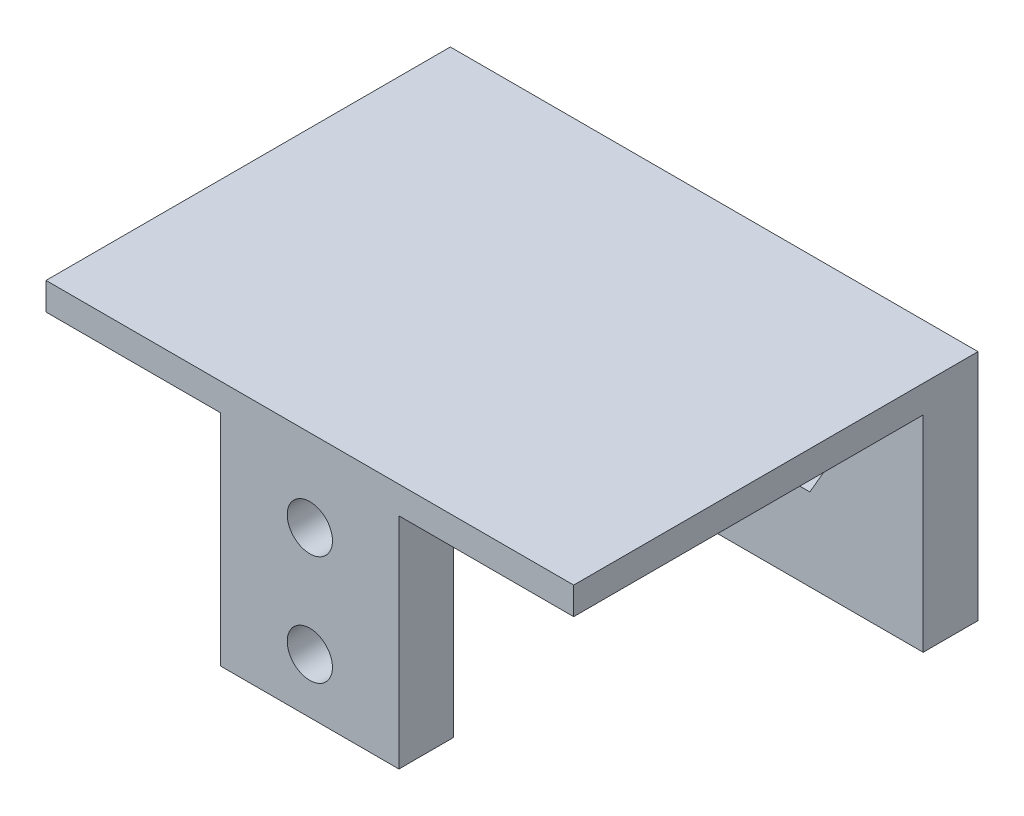
ISO-10303-21;
HEADER;
FILE_DESCRIPTION(('STEP AP214'),'2;1');
FILE_NAME('part.step','',(''),(''),'','','');
FILE_SCHEMA(('AUTOMOTIVE_DESIGN { 1 0 10303 214 1 1 1 1 }'));
ENDSEC;
DATA;
#1=APPLICATION_CONTEXT('core data for automotive mechanical design processes');
#2=APPLICATION_PROTOCOL_DEFINITION('international standard','automotive_design',2000,#1);
#3=PRODUCT_CONTEXT('',#1,'mechanical');
#4=PRODUCT('Part','Part','',(#3));
#5=PRODUCT_RELATED_PRODUCT_CATEGORY('part','',(#4));
#6=PRODUCT_DEFINITION_FORMATION('','',#4);
#7=PRODUCT_DEFINITION_CONTEXT('part definition',#1,'design');
#8=PRODUCT_DEFINITION('design','',#6,#7);
#9=PRODUCT_DEFINITION_SHAPE('','',#8);
#10=(LENGTH_UNIT() NAMED_UNIT(*) SI_UNIT(.MILLI.,.METRE.));
#11=(NAMED_UNIT(*) PLANE_ANGLE_UNIT() SI_UNIT($,.RADIAN.));
#12=(NAMED_UNIT(*) SI_UNIT($,.STERADIAN.) SOLID_ANGLE_UNIT());
#13=UNCERTAINTY_MEASURE_WITH_UNIT(LENGTH_MEASURE(1.E-05),#10,'distance_accuracy_value','');
#14=(GEOMETRIC_REPRESENTATION_CONTEXT(3) GLOBAL_UNCERTAINTY_ASSIGNED_CONTEXT((#13)) GLOBAL_UNIT_ASSIGNED_CONTEXT((#10,
#11,#12)) REPRESENTATION_CONTEXT('',''));
#15=CARTESIAN_POINT('',(0.,0.,0.));
#16=DIRECTION('',(0.,0.,1.));
#17=DIRECTION('',(1.,0.,0.));
#18=AXIS2_PLACEMENT_3D('',#15,#16,#17);
#19=CARTESIAN_POINT('',(0.,0.,0.));
#20=DIRECTION('',(0.,1.,0.));
#21=DIRECTION('',(0.,0.,1.));
#22=AXIS2_PLACEMENT_3D('',#19,#20,#21);
#23=PLANE('',#22);
#24=DIRECTION('',(-1.,0.,0.));
#25=VECTOR('',#24,1.);
#26=CARTESIAN_POINT('',(38.5,0.,4.));
#27=LINE('',#26,#25);
#28=CARTESIAN_POINT('',(38.5,0.,4.));
#29=VERTEX_POINT('',#28);
#30=CARTESIAN_POINT('',(0.,0.,4.));
#31=VERTEX_POINT('',#30);
#32=EDGE_CURVE('E298',#29,#31,#27,.T.);
#33=ORIENTED_EDGE('',*,*,#32,.F.);
#34=DIRECTION('',(0.,0.,-1.));
#35=VECTOR('',#34,1.);
#36=CARTESIAN_POINT('',(38.5,0.,0.));
#37=LINE('',#36,#35);
#38=CARTESIAN_POINT('',(38.5,0.,29.5));
#39=VERTEX_POINT('',#38);
#40=EDGE_CURVE('E346',#39,#29,#37,.T.);
#41=ORIENTED_EDGE('',*,*,#40,.F.);
#42=DIRECTION('',(1.,0.,0.));
#43=VECTOR('',#42,1.);
#44=CARTESIAN_POINT('',(0.,0.,29.5));
#45=LINE('',#44,#43);
#46=CARTESIAN_POINT('',(25.75,0.,29.5));
#47=VERTEX_POINT('',#46);
#48=EDGE_CURVE('E354',#47,#39,#45,.T.);
#49=ORIENTED_EDGE('',*,*,#48,.F.);
#50=DIRECTION('',(0.,0.,1.));
#51=VECTOR('',#50,1.);
#52=CARTESIAN_POINT('',(25.75,0.,25.5));
#53=LINE('',#52,#51);
#54=CARTESIAN_POINT('',(25.75,0.,25.5));
#55=VERTEX_POINT('',#54);
#56=EDGE_CURVE('E337',#55,#47,#53,.T.);
#57=ORIENTED_EDGE('',*,*,#56,.F.);
#58=DIRECTION('',(-1.,0.,0.));
#59=VECTOR('',#58,1.);
#60=CARTESIAN_POINT('',(12.75,0.,25.5));
#61=LINE('',#60,#59);
#62=CARTESIAN_POINT('',(12.75,0.,25.5));
#63=VERTEX_POINT('',#62);
#64=EDGE_CURVE('E322',#55,#63,#61,.T.);
#65=ORIENTED_EDGE('',*,*,#64,.T.);
#66=DIRECTION('',(0.,0.,1.));
#67=VECTOR('',#66,1.);
#68=CARTESIAN_POINT('',(12.75,0.,25.5));
#69=LINE('',#68,#67);
#70=CARTESIAN_POINT('',(12.75,0.,29.5));
#71=VERTEX_POINT('',#70);
#72=EDGE_CURVE('E333',#63,#71,#69,.T.);
#73=ORIENTED_EDGE('',*,*,#72,.T.);
#74=CARTESIAN_POINT('',(0.,0.,29.5));
#75=VERTEX_POINT('',#74);
#76=EDGE_CURVE('E355',#75,#71,#45,.T.);
#77=ORIENTED_EDGE('',*,*,#76,.F.);
#78=DIRECTION('',(0.,0.,1.));
#79=VECTOR('',#78,1.);
#80=CARTESIAN_POINT('',(0.,0.,0.));
#81=LINE('',#80,#79);
#82=EDGE_CURVE('E336',#31,#75,#81,.T.);
#83=ORIENTED_EDGE('',*,*,#82,.F.);
#84=EDGE_LOOP('',(#33,#41,#49,#57,#65,#73,#77,#83));
#85=FACE_BOUND('',#84,.T.);
#86=ADVANCED_FACE('F33',(#85),#23,.F.);
#87=CARTESIAN_POINT('',(0.,2.,0.));
#88=DIRECTION('',(1.,0.,0.));
#89=DIRECTION('',(0.,0.,-1.));
#90=AXIS2_PLACEMENT_3D('',#87,#88,#89);
#91=PLANE('',#90);
#92=DIRECTION('',(0.,-1.,0.));
#93=VECTOR('',#92,1.);
#94=CARTESIAN_POINT('',(0.,2.,0.));
#95=LINE('',#94,#93);
#96=CARTESIAN_POINT('',(0.,2.,0.));
#97=VERTEX_POINT('',#96);
#98=CARTESIAN_POINT('',(0.,-15.,0.));
#99=VERTEX_POINT('',#98);
#100=EDGE_CURVE('E352',#97,#99,#95,.T.);
#101=ORIENTED_EDGE('',*,*,#100,.T.);
#102=DIRECTION('',(0.,0.,-1.));
#103=VECTOR('',#102,1.);
#104=CARTESIAN_POINT('',(0.,-15.,0.));
#105=LINE('',#104,#103);
#106=CARTESIAN_POINT('',(0.,-15.,4.));
#107=VERTEX_POINT('',#106);
#108=EDGE_CURVE('E300',#107,#99,#105,.T.);
#109=ORIENTED_EDGE('',*,*,#108,.F.);
#110=DIRECTION('',(0.,1.,0.));
#111=VECTOR('',#110,1.);
#112=CARTESIAN_POINT('',(0.,-15.,4.));
#113=LINE('',#112,#111);
#114=EDGE_CURVE('E306',#107,#31,#113,.T.);
#115=ORIENTED_EDGE('',*,*,#114,.T.);
#116=ORIENTED_EDGE('',*,*,#82,.T.);
#117=DIRECTION('',(0.,-1.,0.));
#118=VECTOR('',#117,1.);
#119=CARTESIAN_POINT('',(0.,2.,29.5));
#120=LINE('',#119,#118);
#121=CARTESIAN_POINT('',(0.,2.,29.5));
#122=VERTEX_POINT('',#121);
#123=EDGE_CURVE('E11',#122,#75,#120,.T.);
#124=ORIENTED_EDGE('',*,*,#123,.F.);
#125=DIRECTION('',(0.,0.,1.));
#126=VECTOR('',#125,1.);
#127=CARTESIAN_POINT('',(0.,2.,0.));
#128=LINE('',#127,#126);
#129=EDGE_CURVE('E342',#97,#122,#128,.T.);
#130=ORIENTED_EDGE('',*,*,#129,.F.);
#131=EDGE_LOOP('',(#101,#109,#115,#116,#124,#130));
#132=FACE_BOUND('',#131,.T.);
#133=ADVANCED_FACE('F35',(#132),#91,.F.);
#134=CARTESIAN_POINT('',(0.,2.,29.5));
#135=DIRECTION('',(0.,0.,-1.));
#136=DIRECTION('',(-1.,0.,0.));
#137=AXIS2_PLACEMENT_3D('',#134,#135,#136);
#138=PLANE('',#137);
#139=CARTESIAN_POINT('',(19.25,-12.,29.5));
#140=DIRECTION('',(0.,0.,1.));
#141=DIRECTION('',(1.,0.,0.));
#142=AXIS2_PLACEMENT_3D('',#139,#140,#141);
#143=CIRCLE('',#142,1.65);
#144=CARTESIAN_POINT('',(20.9,-12.,29.5));
#145=VERTEX_POINT('',#144);
#146=EDGE_CURVE('E278',#145,#145,#143,.T.);
#147=ORIENTED_EDGE('',*,*,#146,.F.);
#148=EDGE_LOOP('',(#147));
#149=FACE_BOUND('',#148,.T.);
#150=CARTESIAN_POINT('',(19.25,-4.,29.5));
#151=DIRECTION('',(0.,0.,1.));
#152=DIRECTION('',(1.,0.,0.));
#153=AXIS2_PLACEMENT_3D('',#150,#151,#152);
#154=CIRCLE('',#153,1.65);
#155=CARTESIAN_POINT('',(20.9,-4.,29.5));
#156=VERTEX_POINT('',#155);
#157=EDGE_CURVE('E290',#156,#156,#154,.T.);
#158=ORIENTED_EDGE('',*,*,#157,.F.);
#159=EDGE_LOOP('',(#158));
#160=FACE_BOUND('',#159,.T.);
#161=ORIENTED_EDGE('',*,*,#76,.T.);
#162=DIRECTION('',(0.,-1.,0.));
#163=VECTOR('',#162,1.);
#164=CARTESIAN_POINT('',(12.75,0.,29.5));
#165=LINE('',#164,#163);
#166=CARTESIAN_POINT('',(12.75,-16.,29.5));
#167=VERTEX_POINT('',#166);
#168=EDGE_CURVE('E312',#71,#167,#165,.T.);
#169=ORIENTED_EDGE('',*,*,#168,.T.);
#170=DIRECTION('',(1.,0.,0.));
#171=VECTOR('',#170,1.);
#172=CARTESIAN_POINT('',(12.75,-16.,29.5));
#173=LINE('',#172,#171);
#174=CARTESIAN_POINT('',(25.75,-16.,29.5));
#175=VERTEX_POINT('',#174);
#176=EDGE_CURVE('E328',#167,#175,#173,.T.);
#177=ORIENTED_EDGE('',*,*,#176,.T.);
#178=DIRECTION('',(0.,1.,0.));
#179=VECTOR('',#178,1.);
#180=CARTESIAN_POINT('',(25.75,0.,29.5));
#181=LINE('',#180,#179);
#182=EDGE_CURVE('E317',#175,#47,#181,.T.);
#183=ORIENTED_EDGE('',*,*,#182,.T.);
#184=ORIENTED_EDGE('',*,*,#48,.T.);
#185=DIRECTION('',(0.,-1.,0.));
#186=VECTOR('',#185,1.);
#187=CARTESIAN_POINT('',(38.5,2.,29.5));
#188=LINE('',#187,#186);
#189=CARTESIAN_POINT('',(38.5,2.,29.5));
#190=VERTEX_POINT('',#189);
#191=EDGE_CURVE('E42',#190,#39,#188,.T.);
#192=ORIENTED_EDGE('',*,*,#191,.F.);
#193=DIRECTION('',(1.,0.,0.));
#194=VECTOR('',#193,1.);
#195=CARTESIAN_POINT('',(0.,2.,29.5));
#196=LINE('',#195,#194);
#197=EDGE_CURVE('E345',#122,#190,#196,.T.);
#198=ORIENTED_EDGE('',*,*,#197,.F.);
#199=ORIENTED_EDGE('',*,*,#123,.T.);
#200=EDGE_LOOP('',(#161,#169,#177,#183,#184,#192,#198,#199));
#201=FACE_BOUND('',#200,.T.);
#202=ADVANCED_FACE('F392',(#149,#160,#201),#138,.F.);
#203=CARTESIAN_POINT('',(38.5,2.,0.));
#204=DIRECTION('',(-1.,0.,0.));
#205=DIRECTION('',(0.,0.,1.));
#206=AXIS2_PLACEMENT_3D('',#203,#204,#205);
#207=PLANE('',#206);
#208=ORIENTED_EDGE('',*,*,#40,.T.);
#209=DIRECTION('',(0.,1.,0.));
#210=VECTOR('',#209,1.);
#211=CARTESIAN_POINT('',(38.5,-15.,4.));
#212=LINE('',#211,#210);
#213=CARTESIAN_POINT('',(38.5,-15.,4.));
#214=VERTEX_POINT('',#213);
#215=EDGE_CURVE('E310',#214,#29,#212,.T.);
#216=ORIENTED_EDGE('',*,*,#215,.F.);
#217=DIRECTION('',(0.,0.,1.));
#218=VECTOR('',#217,1.);
#219=CARTESIAN_POINT('',(38.5,-15.,0.));
#220=LINE('',#219,#218);
#221=CARTESIAN_POINT('',(38.5,-15.,0.));
#222=VERTEX_POINT('',#221);
#223=EDGE_CURVE('E294',#222,#214,#220,.T.);
#224=ORIENTED_EDGE('',*,*,#223,.F.);
#225=DIRECTION('',(0.,-1.,0.));
#226=VECTOR('',#225,1.);
#227=CARTESIAN_POINT('',(38.5,2.,0.));
#228=LINE('',#227,#226);
#229=CARTESIAN_POINT('',(38.5,2.,0.));
#230=VERTEX_POINT('',#229);
#231=EDGE_CURVE('E361',#230,#222,#228,.T.);
#232=ORIENTED_EDGE('',*,*,#231,.F.);
#233=DIRECTION('',(0.,0.,-1.));
#234=VECTOR('',#233,1.);
#235=CARTESIAN_POINT('',(38.5,2.,0.));
#236=LINE('',#235,#234);
#237=EDGE_CURVE('E348',#190,#230,#236,.T.);
#238=ORIENTED_EDGE('',*,*,#237,.F.);
#239=ORIENTED_EDGE('',*,*,#191,.T.);
#240=EDGE_LOOP('',(#208,#216,#224,#232,#238,#239));
#241=FACE_BOUND('',#240,.T.);
#242=ADVANCED_FACE('F402',(#241),#207,.F.);
#243=CARTESIAN_POINT('',(0.,2.,0.));
#244=DIRECTION('',(0.,0.,1.));
#245=DIRECTION('',(1.,0.,0.));
#246=AXIS2_PLACEMENT_3D('',#243,#244,#245);
#247=PLANE('',#246);
#248=CARTESIAN_POINT('',(28.5,-5.99999999999999,0.));
#249=DIRECTION('',(0.,0.,1.));
#250=DIRECTION('',(1.,0.,0.));
#251=AXIS2_PLACEMENT_3D('',#248,#249,#250);
#252=CIRCLE('',#251,1.65);
#253=CARTESIAN_POINT('',(30.15,-5.99999999999999,0.));
#254=VERTEX_POINT('',#253);
#255=EDGE_CURVE('E682',#254,#254,#252,.T.);
#256=ORIENTED_EDGE('',*,*,#255,.T.);
#257=EDGE_LOOP('',(#256));
#258=FACE_BOUND('',#257,.T.);
#259=CARTESIAN_POINT('',(10.,-6.,0.));
#260=DIRECTION('',(0.,0.,1.));
#261=DIRECTION('',(1.,0.,0.));
#262=AXIS2_PLACEMENT_3D('',#259,#260,#261);
#263=CIRCLE('',#262,1.65);
#264=CARTESIAN_POINT('',(11.65,-6.,0.));
#265=VERTEX_POINT('',#264);
#266=EDGE_CURVE('E211',#265,#265,#263,.T.);
#267=ORIENTED_EDGE('',*,*,#266,.T.);
#268=EDGE_LOOP('',(#267));
#269=FACE_BOUND('',#268,.T.);
#270=ORIENTED_EDGE('',*,*,#231,.T.);
#271=DIRECTION('',(1.,0.,0.));
#272=VECTOR('',#271,1.);
#273=CARTESIAN_POINT('',(38.5,-15.,0.));
#274=LINE('',#273,#272);
#275=EDGE_CURVE('E303',#99,#222,#274,.T.);
#276=ORIENTED_EDGE('',*,*,#275,.F.);
#277=ORIENTED_EDGE('',*,*,#100,.F.);
#278=DIRECTION('',(-1.,0.,0.));
#279=VECTOR('',#278,1.);
#280=CARTESIAN_POINT('',(0.,2.,0.));
#281=LINE('',#280,#279);
#282=EDGE_CURVE('E350',#230,#97,#281,.T.);
#283=ORIENTED_EDGE('',*,*,#282,.F.);
#284=EDGE_LOOP('',(#270,#276,#277,#283));
#285=FACE_BOUND('',#284,.T.);
#286=ADVANCED_FACE('F399',(#258,#269,#285),#247,.F.);
#287=CARTESIAN_POINT('',(0.,2.,0.));
#288=DIRECTION('',(0.,1.,0.));
#289=DIRECTION('',(0.,0.,1.));
#290=AXIS2_PLACEMENT_3D('',#287,#288,#289);
#291=PLANE('',#290);
#292=ORIENTED_EDGE('',*,*,#129,.T.);
#293=ORIENTED_EDGE('',*,*,#197,.T.);
#294=ORIENTED_EDGE('',*,*,#237,.T.);
#295=ORIENTED_EDGE('',*,*,#282,.T.);
#296=EDGE_LOOP('',(#292,#293,#294,#295));
#297=FACE_BOUND('',#296,.T.);
#298=ADVANCED_FACE('F397',(#297),#291,.T.);
#299=CARTESIAN_POINT('',(12.75,0.,25.5));
#300=DIRECTION('',(-1.,0.,0.));
#301=DIRECTION('',(0.,-1.,0.));
#302=AXIS2_PLACEMENT_3D('',#299,#300,#301);
#303=PLANE('',#302);
#304=ORIENTED_EDGE('',*,*,#168,.F.);
#305=ORIENTED_EDGE('',*,*,#72,.F.);
#306=DIRECTION('',(0.,-1.,0.));
#307=VECTOR('',#306,1.);
#308=CARTESIAN_POINT('',(12.75,0.,25.5));
#309=LINE('',#308,#307);
#310=CARTESIAN_POINT('',(12.75,-16.,25.5));
#311=VERTEX_POINT('',#310);
#312=EDGE_CURVE('E313',#63,#311,#309,.T.);
#313=ORIENTED_EDGE('',*,*,#312,.T.);
#314=DIRECTION('',(0.,0.,1.));
#315=VECTOR('',#314,1.);
#316=CARTESIAN_POINT('',(12.75,-16.,25.5));
#317=LINE('',#316,#315);
#318=EDGE_CURVE('E325',#311,#167,#317,.T.);
#319=ORIENTED_EDGE('',*,*,#318,.T.);
#320=EDGE_LOOP('',(#304,#305,#313,#319));
#321=FACE_BOUND('',#320,.T.);
#322=ADVANCED_FACE('F421',(#321),#303,.T.);
#323=CARTESIAN_POINT('',(25.75,0.,25.5));
#324=DIRECTION('',(1.,0.,0.));
#325=DIRECTION('',(0.,1.,0.));
#326=AXIS2_PLACEMENT_3D('',#323,#324,#325);
#327=PLANE('',#326);
#328=ORIENTED_EDGE('',*,*,#182,.F.);
#329=DIRECTION('',(0.,0.,1.));
#330=VECTOR('',#329,1.);
#331=CARTESIAN_POINT('',(25.75,-16.,25.5));
#332=LINE('',#331,#330);
#333=CARTESIAN_POINT('',(25.75,-16.,25.5));
#334=VERTEX_POINT('',#333);
#335=EDGE_CURVE('E339',#334,#175,#332,.T.);
#336=ORIENTED_EDGE('',*,*,#335,.F.);
#337=DIRECTION('',(0.,1.,0.));
#338=VECTOR('',#337,1.);
#339=CARTESIAN_POINT('',(25.75,0.,25.5));
#340=LINE('',#339,#338);
#341=EDGE_CURVE('E320',#334,#55,#340,.T.);
#342=ORIENTED_EDGE('',*,*,#341,.T.);
#343=ORIENTED_EDGE('',*,*,#56,.T.);
#344=EDGE_LOOP('',(#328,#336,#342,#343));
#345=FACE_BOUND('',#344,.T.);
#346=ADVANCED_FACE('F455',(#345),#327,.T.);
#347=CARTESIAN_POINT('',(12.75,-16.,25.5));
#348=DIRECTION('',(0.,-1.,0.));
#349=DIRECTION('',(0.,0.,-1.));
#350=AXIS2_PLACEMENT_3D('',#347,#348,#349);
#351=PLANE('',#350);
#352=ORIENTED_EDGE('',*,*,#176,.F.);
#353=ORIENTED_EDGE('',*,*,#318,.F.);
#354=DIRECTION('',(1.,0.,0.));
#355=VECTOR('',#354,1.);
#356=CARTESIAN_POINT('',(12.75,-16.,25.5));
#357=LINE('',#356,#355);
#358=EDGE_CURVE('E316',#311,#334,#357,.T.);
#359=ORIENTED_EDGE('',*,*,#358,.T.);
#360=ORIENTED_EDGE('',*,*,#335,.T.);
#361=EDGE_LOOP('',(#352,#353,#359,#360));
#362=FACE_BOUND('',#361,.T.);
#363=ADVANCED_FACE('F426',(#362),#351,.T.);
#364=CARTESIAN_POINT('',(0.,0.,25.5));
#365=DIRECTION('',(0.,0.,1.));
#366=DIRECTION('',(1.,0.,0.));
#367=AXIS2_PLACEMENT_3D('',#364,#365,#366);
#368=PLANE('',#367);
#369=CARTESIAN_POINT('',(19.25,-12.,25.5));
#370=DIRECTION('',(0.,0.,1.));
#371=DIRECTION('',(1.,0.,0.));
#372=AXIS2_PLACEMENT_3D('',#369,#370,#371);
#373=CIRCLE('',#372,1.65);
#374=CARTESIAN_POINT('',(20.9,-12.,25.5));
#375=VERTEX_POINT('',#374);
#376=EDGE_CURVE('E37',#375,#375,#373,.T.);
#377=ORIENTED_EDGE('',*,*,#376,.T.);
#378=EDGE_LOOP('',(#377));
#379=FACE_BOUND('',#378,.T.);
#380=CARTESIAN_POINT('',(19.25,-4.,25.5));
#381=DIRECTION('',(0.,0.,1.));
#382=DIRECTION('',(1.,0.,0.));
#383=AXIS2_PLACEMENT_3D('',#380,#381,#382);
#384=CIRCLE('',#383,1.65);
#385=CARTESIAN_POINT('',(20.9,-4.,25.5));
#386=VERTEX_POINT('',#385);
#387=EDGE_CURVE('E293',#386,#386,#384,.T.);
#388=ORIENTED_EDGE('',*,*,#387,.T.);
#389=EDGE_LOOP('',(#388));
#390=FACE_BOUND('',#389,.T.);
#391=ORIENTED_EDGE('',*,*,#312,.F.);
#392=ORIENTED_EDGE('',*,*,#64,.F.);
#393=ORIENTED_EDGE('',*,*,#341,.F.);
#394=ORIENTED_EDGE('',*,*,#358,.F.);
#395=EDGE_LOOP('',(#391,#392,#393,#394));
#396=FACE_BOUND('',#395,.T.);
#397=ADVANCED_FACE('F367',(#379,#390,#396),#368,.F.);
#398=CARTESIAN_POINT('',(38.5,-15.,4.));
#399=DIRECTION('',(0.,0.,-1.));
#400=DIRECTION('',(-1.,0.,0.));
#401=AXIS2_PLACEMENT_3D('',#398,#399,#400);
#402=PLANE('',#401);
#403=DIRECTION('',(0.499999999999995,0.866025403784441,0.));
#404=VECTOR('',#403,1.);
#405=CARTESIAN_POINT('',(30.2320508075689,-8.99999999999999,4.));
#406=LINE('',#405,#404);
#407=CARTESIAN_POINT('',(30.2320508075689,-8.99999999999999,4.));
#408=VERTEX_POINT('',#407);
#409=CARTESIAN_POINT('',(31.9641016151377,-5.99999999999998,4.));
#410=VERTEX_POINT('',#409);
#411=EDGE_CURVE('E222',#408,#410,#406,.T.);
#412=ORIENTED_EDGE('',*,*,#411,.F.);
#413=DIRECTION('',(1.,0.,0.));
#414=VECTOR('',#413,1.);
#415=CARTESIAN_POINT('',(26.7679491924311,-9.,4.));
#416=LINE('',#415,#414);
#417=CARTESIAN_POINT('',(26.7679491924311,-9.,4.));
#418=VERTEX_POINT('',#417);
#419=EDGE_CURVE('E50',#418,#408,#416,.T.);
#420=ORIENTED_EDGE('',*,*,#419,.F.);
#421=DIRECTION('',(0.500000000000004,-0.866025403784436,0.));
#422=VECTOR('',#421,1.);
#423=CARTESIAN_POINT('',(25.0358983848622,-6.00000000000002,4.));
#424=LINE('',#423,#422);
#425=CARTESIAN_POINT('',(25.0358983848622,-6.00000000000002,4.));
#426=VERTEX_POINT('',#425);
#427=EDGE_CURVE('E205',#426,#418,#424,.T.);
#428=ORIENTED_EDGE('',*,*,#427,.F.);
#429=DIRECTION('',(-0.5,-0.866025403784439,0.));
#430=VECTOR('',#429,1.);
#431=CARTESIAN_POINT('',(26.7679491924311,-3.,4.));
#432=LINE('',#431,#430);
#433=CARTESIAN_POINT('',(26.7679491924311,-3.,4.));
#434=VERTEX_POINT('',#433);
#435=EDGE_CURVE('E208',#434,#426,#432,.T.);
#436=ORIENTED_EDGE('',*,*,#435,.F.);
#437=DIRECTION('',(-1.,0.,0.));
#438=VECTOR('',#437,1.);
#439=CARTESIAN_POINT('',(30.2320508075689,-2.99999999999999,4.));
#440=LINE('',#439,#438);
#441=CARTESIAN_POINT('',(30.2320508075689,-2.99999999999999,4.));
#442=VERTEX_POINT('',#441);
#443=EDGE_CURVE('E227',#442,#434,#440,.T.);
#444=ORIENTED_EDGE('',*,*,#443,.F.);
#445=DIRECTION('',(-0.500000000000003,0.866025403784437,0.));
#446=VECTOR('',#445,1.);
#447=CARTESIAN_POINT('',(31.9641016151377,-5.99999999999998,4.));
#448=LINE('',#447,#446);
#449=EDGE_CURVE('E224',#410,#442,#448,.T.);
#450=ORIENTED_EDGE('',*,*,#449,.F.);
#451=EDGE_LOOP('',(#412,#420,#428,#436,#444,#450));
#452=FACE_BOUND('',#451,.T.);
#453=DIRECTION('',(0.500000000000002,0.866025403784438,0.));
#454=VECTOR('',#453,1.);
#455=CARTESIAN_POINT('',(11.7320508075689,-9.00000000000001,4.));
#456=LINE('',#455,#454);
#457=CARTESIAN_POINT('',(11.7320508075689,-9.00000000000001,4.));
#458=VERTEX_POINT('',#457);
#459=CARTESIAN_POINT('',(13.4641016151378,-6.00000000000001,4.));
#460=VERTEX_POINT('',#459);
#461=EDGE_CURVE('E262',#458,#460,#456,.T.);
#462=ORIENTED_EDGE('',*,*,#461,.F.);
#463=DIRECTION('',(1.,0.,0.));
#464=VECTOR('',#463,1.);
#465=CARTESIAN_POINT('',(8.26794919243111,-9.,4.));
#466=LINE('',#465,#464);
#467=CARTESIAN_POINT('',(8.26794919243111,-9.,4.));
#468=VERTEX_POINT('',#467);
#469=EDGE_CURVE('E58',#468,#458,#466,.T.);
#470=ORIENTED_EDGE('',*,*,#469,.F.);
#471=DIRECTION('',(0.499999999999998,-0.86602540378444,0.));
#472=VECTOR('',#471,1.);
#473=CARTESIAN_POINT('',(6.53589838486224,-5.99999999999999,4.));
#474=LINE('',#473,#472);
#475=CARTESIAN_POINT('',(6.53589838486224,-5.99999999999999,4.));
#476=VERTEX_POINT('',#475);
#477=EDGE_CURVE('E245',#476,#468,#474,.T.);
#478=ORIENTED_EDGE('',*,*,#477,.F.);
#479=DIRECTION('',(-0.500000000000002,-0.866025403784437,0.));
#480=VECTOR('',#479,1.);
#481=CARTESIAN_POINT('',(8.26794919243113,-2.99999999999999,4.));
#482=LINE('',#481,#480);
#483=CARTESIAN_POINT('',(8.26794919243113,-2.99999999999999,4.));
#484=VERTEX_POINT('',#483);
#485=EDGE_CURVE('E271',#484,#476,#482,.T.);
#486=ORIENTED_EDGE('',*,*,#485,.F.);
#487=DIRECTION('',(-1.,0.,0.));
#488=VECTOR('',#487,1.);
#489=CARTESIAN_POINT('',(11.7320508075689,-3.,4.));
#490=LINE('',#489,#488);
#491=CARTESIAN_POINT('',(11.7320508075689,-3.,4.));
#492=VERTEX_POINT('',#491);
#493=EDGE_CURVE('E268',#492,#484,#490,.T.);
#494=ORIENTED_EDGE('',*,*,#493,.F.);
#495=DIRECTION('',(-0.499999999999999,0.866025403784439,0.));
#496=VECTOR('',#495,1.);
#497=CARTESIAN_POINT('',(13.4641016151378,-6.00000000000001,4.));
#498=LINE('',#497,#496);
#499=EDGE_CURVE('E265',#460,#492,#498,.T.);
#500=ORIENTED_EDGE('',*,*,#499,.F.);
#501=EDGE_LOOP('',(#462,#470,#478,#486,#494,#500));
#502=FACE_BOUND('',#501,.T.);
#503=ORIENTED_EDGE('',*,*,#32,.T.);
#504=ORIENTED_EDGE('',*,*,#114,.F.);
#505=DIRECTION('',(-1.,0.,0.));
#506=VECTOR('',#505,1.);
#507=CARTESIAN_POINT('',(38.5,-15.,4.));
#508=LINE('',#507,#506);
#509=EDGE_CURVE('E297',#214,#107,#508,.T.);
#510=ORIENTED_EDGE('',*,*,#509,.F.);
#511=ORIENTED_EDGE('',*,*,#215,.T.);
#512=EDGE_LOOP('',(#503,#504,#510,#511));
#513=FACE_BOUND('',#512,.T.);
#514=ADVANCED_FACE('F383',(#452,#502,#513),#402,.F.);
#515=CARTESIAN_POINT('',(0.,-15.,0.));
#516=DIRECTION('',(0.,-1.,0.));
#517=DIRECTION('',(0.,0.,-1.));
#518=AXIS2_PLACEMENT_3D('',#515,#516,#517);
#519=PLANE('',#518);
#520=ORIENTED_EDGE('',*,*,#223,.T.);
#521=ORIENTED_EDGE('',*,*,#509,.T.);
#522=ORIENTED_EDGE('',*,*,#108,.T.);
#523=ORIENTED_EDGE('',*,*,#275,.T.);
#524=EDGE_LOOP('',(#520,#521,#522,#523));
#525=FACE_BOUND('',#524,.T.);
#526=ADVANCED_FACE('F373',(#525),#519,.T.);
#527=CARTESIAN_POINT('',(19.25,-4.,14.5));
#528=DIRECTION('',(0.,0.,1.));
#529=DIRECTION('',(1.,0.,0.));
#530=AXIS2_PLACEMENT_3D('',#527,#528,#529);
#531=CYLINDRICAL_SURFACE('',#530,1.65);
#532=ORIENTED_EDGE('',*,*,#157,.T.);
#533=EDGE_LOOP('',(#532));
#534=FACE_BOUND('',#533,.T.);
#535=ORIENTED_EDGE('',*,*,#387,.F.);
#536=EDGE_LOOP('',(#535));
#537=FACE_BOUND('',#536,.T.);
#538=ADVANCED_FACE('F370',(#534,#537),#531,.F.);
#539=CARTESIAN_POINT('',(19.25,-12.,14.5));
#540=DIRECTION('',(0.,0.,1.));
#541=DIRECTION('',(1.,0.,0.));
#542=AXIS2_PLACEMENT_3D('',#539,#540,#541);
#543=CYLINDRICAL_SURFACE('',#542,1.65);
#544=ORIENTED_EDGE('',*,*,#146,.T.);
#545=EDGE_LOOP('',(#544));
#546=FACE_BOUND('',#545,.T.);
#547=ORIENTED_EDGE('',*,*,#376,.F.);
#548=EDGE_LOOP('',(#547));
#549=FACE_BOUND('',#548,.T.);
#550=ADVANCED_FACE('F372',(#546,#549),#543,.F.);
#551=CARTESIAN_POINT('',(8.26794919243111,-9.,1.5));
#552=DIRECTION('',(0.,-1.,0.));
#553=DIRECTION('',(1.,0.,0.));
#554=AXIS2_PLACEMENT_3D('',#551,#552,#553);
#555=PLANE('',#554);
#556=ORIENTED_EDGE('',*,*,#469,.T.);
#557=DIRECTION('',(0.,0.,1.));
#558=VECTOR('',#557,1.);
#559=CARTESIAN_POINT('',(11.7320508075689,-9.00000000000001,1.5));
#560=LINE('',#559,#558);
#561=CARTESIAN_POINT('',(11.7320508075689,-9.00000000000001,1.5));
#562=VERTEX_POINT('',#561);
#563=EDGE_CURVE('E260',#562,#458,#560,.T.);
#564=ORIENTED_EDGE('',*,*,#563,.F.);
#565=DIRECTION('',(1.,0.,0.));
#566=VECTOR('',#565,1.);
#567=CARTESIAN_POINT('',(8.26794919243111,-9.,1.5));
#568=LINE('',#567,#566);
#569=CARTESIAN_POINT('',(8.26794919243111,-9.,1.5));
#570=VERTEX_POINT('',#569);
#571=EDGE_CURVE('E241',#570,#562,#568,.T.);
#572=ORIENTED_EDGE('',*,*,#571,.F.);
#573=DIRECTION('',(0.,0.,1.));
#574=VECTOR('',#573,1.);
#575=CARTESIAN_POINT('',(8.26794919243111,-9.,1.5));
#576=LINE('',#575,#574);
#577=EDGE_CURVE('E276',#570,#468,#576,.T.);
#578=ORIENTED_EDGE('',*,*,#577,.T.);
#579=EDGE_LOOP('',(#556,#564,#572,#578));
#580=FACE_BOUND('',#579,.T.);
#581=ADVANCED_FACE('F380',(#580),#555,.F.);
#582=CARTESIAN_POINT('',(6.53589838486224,-5.99999999999999,1.5));
#583=DIRECTION('',(-0.86602540378444,-0.499999999999998,0.));
#584=DIRECTION('',(0.499999999999998,-0.86602540378444,0.));
#585=AXIS2_PLACEMENT_3D('',#582,#583,#584);
#586=PLANE('',#585);
#587=ORIENTED_EDGE('',*,*,#477,.T.);
#588=ORIENTED_EDGE('',*,*,#577,.F.);
#589=DIRECTION('',(0.499999999999998,-0.86602540378444,0.));
#590=VECTOR('',#589,1.);
#591=CARTESIAN_POINT('',(6.53589838486224,-5.99999999999999,1.5));
#592=LINE('',#591,#590);
#593=CARTESIAN_POINT('',(6.53589838486224,-5.99999999999999,1.5));
#594=VERTEX_POINT('',#593);
#595=EDGE_CURVE('E257',#594,#570,#592,.T.);
#596=ORIENTED_EDGE('',*,*,#595,.F.);
#597=DIRECTION('',(0.,0.,1.));
#598=VECTOR('',#597,1.);
#599=CARTESIAN_POINT('',(6.53589838486224,-5.99999999999999,1.5));
#600=LINE('',#599,#598);
#601=EDGE_CURVE('E279',#594,#476,#600,.T.);
#602=ORIENTED_EDGE('',*,*,#601,.T.);
#603=EDGE_LOOP('',(#587,#588,#596,#602));
#604=FACE_BOUND('',#603,.T.);
#605=ADVANCED_FACE('F522',(#604),#586,.F.);
#606=CARTESIAN_POINT('',(8.26794919243113,-2.99999999999999,1.5));
#607=DIRECTION('',(-0.866025403784437,0.500000000000002,0.));
#608=DIRECTION('',(-0.500000000000002,-0.866025403784437,0.));
#609=AXIS2_PLACEMENT_3D('',#606,#607,#608);
#610=PLANE('',#609);
#611=ORIENTED_EDGE('',*,*,#485,.T.);
#612=ORIENTED_EDGE('',*,*,#601,.F.);
#613=DIRECTION('',(-0.500000000000002,-0.866025403784437,0.));
#614=VECTOR('',#613,1.);
#615=CARTESIAN_POINT('',(8.26794919243113,-2.99999999999999,1.5));
#616=LINE('',#615,#614);
#617=CARTESIAN_POINT('',(8.26794919243113,-2.99999999999999,1.5));
#618=VERTEX_POINT('',#617);
#619=EDGE_CURVE('E254',#618,#594,#616,.T.);
#620=ORIENTED_EDGE('',*,*,#619,.F.);
#621=DIRECTION('',(0.,0.,1.));
#622=VECTOR('',#621,1.);
#623=CARTESIAN_POINT('',(8.26794919243113,-2.99999999999999,1.5));
#624=LINE('',#623,#622);
#625=EDGE_CURVE('E281',#618,#484,#624,.T.);
#626=ORIENTED_EDGE('',*,*,#625,.T.);
#627=EDGE_LOOP('',(#611,#612,#620,#626));
#628=FACE_BOUND('',#627,.T.);
#629=ADVANCED_FACE('F531',(#628),#610,.F.);
#630=CARTESIAN_POINT('',(11.7320508075689,-3.,1.5));
#631=DIRECTION('',(0.,1.,0.));
#632=DIRECTION('',(-1.,0.,0.));
#633=AXIS2_PLACEMENT_3D('',#630,#631,#632);
#634=PLANE('',#633);
#635=ORIENTED_EDGE('',*,*,#493,.T.);
#636=ORIENTED_EDGE('',*,*,#625,.F.);
#637=DIRECTION('',(-1.,0.,0.));
#638=VECTOR('',#637,1.);
#639=CARTESIAN_POINT('',(11.7320508075689,-3.,1.5));
#640=LINE('',#639,#638);
#641=CARTESIAN_POINT('',(11.7320508075689,-3.,1.5));
#642=VERTEX_POINT('',#641);
#643=EDGE_CURVE('E251',#642,#618,#640,.T.);
#644=ORIENTED_EDGE('',*,*,#643,.F.);
#645=DIRECTION('',(0.,0.,1.));
#646=VECTOR('',#645,1.);
#647=CARTESIAN_POINT('',(11.7320508075689,-3.,1.5));
#648=LINE('',#647,#646);
#649=EDGE_CURVE('E283',#642,#492,#648,.T.);
#650=ORIENTED_EDGE('',*,*,#649,.T.);
#651=EDGE_LOOP('',(#635,#636,#644,#650));
#652=FACE_BOUND('',#651,.T.);
#653=ADVANCED_FACE('F541',(#652),#634,.F.);
#654=CARTESIAN_POINT('',(13.4641016151378,-6.00000000000001,1.5));
#655=DIRECTION('',(0.866025403784439,0.499999999999999,0.));
#656=DIRECTION('',(-0.499999999999999,0.866025403784439,0.));
#657=AXIS2_PLACEMENT_3D('',#654,#655,#656);
#658=PLANE('',#657);
#659=ORIENTED_EDGE('',*,*,#499,.T.);
#660=ORIENTED_EDGE('',*,*,#649,.F.);
#661=DIRECTION('',(-0.499999999999999,0.866025403784439,0.));
#662=VECTOR('',#661,1.);
#663=CARTESIAN_POINT('',(13.4641016151378,-6.00000000000001,1.5));
#664=LINE('',#663,#662);
#665=CARTESIAN_POINT('',(13.4641016151378,-6.00000000000001,1.5));
#666=VERTEX_POINT('',#665);
#667=EDGE_CURVE('E248',#666,#642,#664,.T.);
#668=ORIENTED_EDGE('',*,*,#667,.F.);
#669=DIRECTION('',(0.,0.,1.));
#670=VECTOR('',#669,1.);
#671=CARTESIAN_POINT('',(13.4641016151378,-6.00000000000001,1.5));
#672=LINE('',#671,#670);
#673=EDGE_CURVE('E285',#666,#460,#672,.T.);
#674=ORIENTED_EDGE('',*,*,#673,.T.);
#675=EDGE_LOOP('',(#659,#660,#668,#674));
#676=FACE_BOUND('',#675,.T.);
#677=ADVANCED_FACE('F551',(#676),#658,.F.);
#678=CARTESIAN_POINT('',(11.7320508075689,-9.00000000000001,1.5));
#679=DIRECTION('',(0.866025403784438,-0.500000000000002,0.));
#680=DIRECTION('',(0.500000000000002,0.866025403784438,0.));
#681=AXIS2_PLACEMENT_3D('',#678,#679,#680);
#682=PLANE('',#681);
#683=ORIENTED_EDGE('',*,*,#461,.T.);
#684=ORIENTED_EDGE('',*,*,#673,.F.);
#685=DIRECTION('',(0.500000000000002,0.866025403784438,0.));
#686=VECTOR('',#685,1.);
#687=CARTESIAN_POINT('',(11.7320508075689,-9.00000000000001,1.5));
#688=LINE('',#687,#686);
#689=EDGE_CURVE('E244',#562,#666,#688,.T.);
#690=ORIENTED_EDGE('',*,*,#689,.F.);
#691=ORIENTED_EDGE('',*,*,#563,.T.);
#692=EDGE_LOOP('',(#683,#684,#690,#691));
#693=FACE_BOUND('',#692,.T.);
#694=ADVANCED_FACE('F561',(#693),#682,.F.);
#695=CARTESIAN_POINT('',(0.,0.,1.5));
#696=DIRECTION('',(0.,0.,1.));
#697=DIRECTION('',(1.,0.,0.));
#698=AXIS2_PLACEMENT_3D('',#695,#696,#697);
#699=PLANE('',#698);
#700=CARTESIAN_POINT('',(10.,-6.,1.5));
#701=DIRECTION('',(0.,0.,1.));
#702=DIRECTION('',(1.,0.,0.));
#703=AXIS2_PLACEMENT_3D('',#700,#701,#702);
#704=CIRCLE('',#703,1.65);
#705=CARTESIAN_POINT('',(11.65,-6.,1.5));
#706=VERTEX_POINT('',#705);
#707=EDGE_CURVE('E670',#706,#706,#704,.T.);
#708=ORIENTED_EDGE('',*,*,#707,.F.);
#709=EDGE_LOOP('',(#708));
#710=FACE_BOUND('',#709,.T.);
#711=ORIENTED_EDGE('',*,*,#571,.T.);
#712=ORIENTED_EDGE('',*,*,#689,.T.);
#713=ORIENTED_EDGE('',*,*,#667,.T.);
#714=ORIENTED_EDGE('',*,*,#643,.T.);
#715=ORIENTED_EDGE('',*,*,#619,.T.);
#716=ORIENTED_EDGE('',*,*,#595,.T.);
#717=EDGE_LOOP('',(#711,#712,#713,#714,#715,#716));
#718=FACE_BOUND('',#717,.T.);
#719=ADVANCED_FACE('F571',(#710,#718),#699,.T.);
#720=CARTESIAN_POINT('',(26.7679491924311,-9.,1.5));
#721=DIRECTION('',(0.,-1.,0.));
#722=DIRECTION('',(1.,0.,0.));
#723=AXIS2_PLACEMENT_3D('',#720,#721,#722);
#724=PLANE('',#723);
#725=ORIENTED_EDGE('',*,*,#419,.T.);
#726=DIRECTION('',(0.,0.,1.));
#727=VECTOR('',#726,1.);
#728=CARTESIAN_POINT('',(30.2320508075689,-8.99999999999999,1.5));
#729=LINE('',#728,#727);
#730=CARTESIAN_POINT('',(30.2320508075689,-8.99999999999999,1.5));
#731=VERTEX_POINT('',#730);
#732=EDGE_CURVE('E182',#731,#408,#729,.T.);
#733=ORIENTED_EDGE('',*,*,#732,.F.);
#734=DIRECTION('',(1.,0.,0.));
#735=VECTOR('',#734,1.);
#736=CARTESIAN_POINT('',(26.7679491924311,-9.,1.5));
#737=LINE('',#736,#735);
#738=CARTESIAN_POINT('',(26.7679491924311,-9.,1.5));
#739=VERTEX_POINT('',#738);
#740=EDGE_CURVE('E186',#739,#731,#737,.T.);
#741=ORIENTED_EDGE('',*,*,#740,.F.);
#742=DIRECTION('',(0.,0.,1.));
#743=VECTOR('',#742,1.);
#744=CARTESIAN_POINT('',(26.7679491924311,-9.,1.5));
#745=LINE('',#744,#743);
#746=EDGE_CURVE('E232',#739,#418,#745,.T.);
#747=ORIENTED_EDGE('',*,*,#746,.T.);
#748=EDGE_LOOP('',(#725,#733,#741,#747));
#749=FACE_BOUND('',#748,.T.);
#750=ADVANCED_FACE('F184',(#749),#724,.F.);
#751=CARTESIAN_POINT('',(25.0358983848622,-6.00000000000002,1.5));
#752=DIRECTION('',(-0.866025403784437,-0.500000000000004,0.));
#753=DIRECTION('',(0.500000000000004,-0.866025403784437,0.));
#754=AXIS2_PLACEMENT_3D('',#751,#752,#753);
#755=PLANE('',#754);
#756=ORIENTED_EDGE('',*,*,#427,.T.);
#757=ORIENTED_EDGE('',*,*,#746,.F.);
#758=DIRECTION('',(0.500000000000004,-0.866025403784436,0.));
#759=VECTOR('',#758,1.);
#760=CARTESIAN_POINT('',(25.0358983848622,-6.00000000000002,1.5));
#761=LINE('',#760,#759);
#762=CARTESIAN_POINT('',(25.0358983848622,-6.00000000000002,1.5));
#763=VERTEX_POINT('',#762);
#764=EDGE_CURVE('E192',#763,#739,#761,.T.);
#765=ORIENTED_EDGE('',*,*,#764,.F.);
#766=DIRECTION('',(0.,0.,1.));
#767=VECTOR('',#766,1.);
#768=CARTESIAN_POINT('',(25.0358983848622,-6.00000000000002,1.5));
#769=LINE('',#768,#767);
#770=EDGE_CURVE('E234',#763,#426,#769,.T.);
#771=ORIENTED_EDGE('',*,*,#770,.T.);
#772=EDGE_LOOP('',(#756,#757,#765,#771));
#773=FACE_BOUND('',#772,.T.);
#774=ADVANCED_FACE('F583',(#773),#755,.F.);
#775=CARTESIAN_POINT('',(26.7679491924311,-3.,1.5));
#776=DIRECTION('',(-0.866025403784439,0.5,0.));
#777=DIRECTION('',(-0.5,-0.866025403784439,0.));
#778=AXIS2_PLACEMENT_3D('',#775,#776,#777);
#779=PLANE('',#778);
#780=ORIENTED_EDGE('',*,*,#435,.T.);
#781=ORIENTED_EDGE('',*,*,#770,.F.);
#782=DIRECTION('',(-0.5,-0.866025403784439,0.));
#783=VECTOR('',#782,1.);
#784=CARTESIAN_POINT('',(26.7679491924311,-3.,1.5));
#785=LINE('',#784,#783);
#786=CARTESIAN_POINT('',(26.7679491924311,-3.,1.5));
#787=VERTEX_POINT('',#786);
#788=EDGE_CURVE('E218',#787,#763,#785,.T.);
#789=ORIENTED_EDGE('',*,*,#788,.F.);
#790=DIRECTION('',(0.,0.,1.));
#791=VECTOR('',#790,1.);
#792=CARTESIAN_POINT('',(26.7679491924311,-3.,1.5));
#793=LINE('',#792,#791);
#794=EDGE_CURVE('E236',#787,#434,#793,.T.);
#795=ORIENTED_EDGE('',*,*,#794,.T.);
#796=EDGE_LOOP('',(#780,#781,#789,#795));
#797=FACE_BOUND('',#796,.T.);
#798=ADVANCED_FACE('F592',(#797),#779,.F.);
#799=CARTESIAN_POINT('',(30.2320508075689,-2.99999999999999,1.5));
#800=DIRECTION('',(0.,1.,0.));
#801=DIRECTION('',(-1.,0.,0.));
#802=AXIS2_PLACEMENT_3D('',#799,#800,#801);
#803=PLANE('',#802);
#804=ORIENTED_EDGE('',*,*,#443,.T.);
#805=ORIENTED_EDGE('',*,*,#794,.F.);
#806=DIRECTION('',(-1.,0.,0.));
#807=VECTOR('',#806,1.);
#808=CARTESIAN_POINT('',(30.2320508075689,-2.99999999999999,1.5));
#809=LINE('',#808,#807);
#810=CARTESIAN_POINT('',(30.2320508075689,-2.99999999999999,1.5));
#811=VERTEX_POINT('',#810);
#812=EDGE_CURVE('E215',#811,#787,#809,.T.);
#813=ORIENTED_EDGE('',*,*,#812,.F.);
#814=DIRECTION('',(0.,0.,1.));
#815=VECTOR('',#814,1.);
#816=CARTESIAN_POINT('',(30.2320508075689,-2.99999999999999,1.5));
#817=LINE('',#816,#815);
#818=EDGE_CURVE('E238',#811,#442,#817,.T.);
#819=ORIENTED_EDGE('',*,*,#818,.T.);
#820=EDGE_LOOP('',(#804,#805,#813,#819));
#821=FACE_BOUND('',#820,.T.);
#822=ADVANCED_FACE('F602',(#821),#803,.F.);
#823=CARTESIAN_POINT('',(31.9641016151377,-5.99999999999998,1.5));
#824=DIRECTION('',(0.866025403784437,0.500000000000003,0.));
#825=DIRECTION('',(-0.500000000000003,0.866025403784437,0.));
#826=AXIS2_PLACEMENT_3D('',#823,#824,#825);
#827=PLANE('',#826);
#828=ORIENTED_EDGE('',*,*,#449,.T.);
#829=ORIENTED_EDGE('',*,*,#818,.F.);
#830=DIRECTION('',(-0.500000000000003,0.866025403784437,0.));
#831=VECTOR('',#830,1.);
#832=CARTESIAN_POINT('',(31.9641016151377,-5.99999999999998,1.5));
#833=LINE('',#832,#831);
#834=CARTESIAN_POINT('',(31.9641016151377,-5.99999999999998,1.5));
#835=VERTEX_POINT('',#834);
#836=EDGE_CURVE('E200',#835,#811,#833,.T.);
#837=ORIENTED_EDGE('',*,*,#836,.F.);
#838=DIRECTION('',(0.,0.,1.));
#839=VECTOR('',#838,1.);
#840=CARTESIAN_POINT('',(31.9641016151377,-5.99999999999998,1.5));
#841=LINE('',#840,#839);
#842=EDGE_CURVE('E191',#835,#410,#841,.T.);
#843=ORIENTED_EDGE('',*,*,#842,.T.);
#844=EDGE_LOOP('',(#828,#829,#837,#843));
#845=FACE_BOUND('',#844,.T.);
#846=ADVANCED_FACE('F612',(#845),#827,.F.);
#847=CARTESIAN_POINT('',(30.2320508075689,-8.99999999999999,1.5));
#848=DIRECTION('',(0.866025403784442,-0.499999999999995,0.));
#849=DIRECTION('',(0.499999999999995,0.866025403784442,0.));
#850=AXIS2_PLACEMENT_3D('',#847,#848,#849);
#851=PLANE('',#850);
#852=ORIENTED_EDGE('',*,*,#411,.T.);
#853=ORIENTED_EDGE('',*,*,#842,.F.);
#854=DIRECTION('',(0.499999999999995,0.866025403784441,0.));
#855=VECTOR('',#854,1.);
#856=CARTESIAN_POINT('',(30.2320508075689,-8.99999999999999,1.5));
#857=LINE('',#856,#855);
#858=EDGE_CURVE('E195',#731,#835,#857,.T.);
#859=ORIENTED_EDGE('',*,*,#858,.F.);
#860=ORIENTED_EDGE('',*,*,#732,.T.);
#861=EDGE_LOOP('',(#852,#853,#859,#860));
#862=FACE_BOUND('',#861,.T.);
#863=ADVANCED_FACE('F196',(#862),#851,.F.);
#864=CARTESIAN_POINT('',(0.,0.,1.5));
#865=DIRECTION('',(0.,0.,1.));
#866=DIRECTION('',(1.,0.,0.));
#867=AXIS2_PLACEMENT_3D('',#864,#865,#866);
#868=PLANE('',#867);
#869=CARTESIAN_POINT('',(28.5,-5.99999999999999,1.5));
#870=DIRECTION('',(0.,0.,1.));
#871=DIRECTION('',(1.,0.,0.));
#872=AXIS2_PLACEMENT_3D('',#869,#870,#871);
#873=CIRCLE('',#872,1.65);
#874=CARTESIAN_POINT('',(30.15,-5.99999999999999,1.5));
#875=VERTEX_POINT('',#874);
#876=EDGE_CURVE('E685',#875,#875,#873,.T.);
#877=ORIENTED_EDGE('',*,*,#876,.F.);
#878=EDGE_LOOP('',(#877));
#879=FACE_BOUND('',#878,.T.);
#880=ORIENTED_EDGE('',*,*,#740,.T.);
#881=ORIENTED_EDGE('',*,*,#858,.T.);
#882=ORIENTED_EDGE('',*,*,#836,.T.);
#883=ORIENTED_EDGE('',*,*,#812,.T.);
#884=ORIENTED_EDGE('',*,*,#788,.T.);
#885=ORIENTED_EDGE('',*,*,#764,.T.);
#886=EDGE_LOOP('',(#880,#881,#882,#883,#884,#885));
#887=FACE_BOUND('',#886,.T.);
#888=ADVANCED_FACE('F202',(#879,#887),#868,.T.);
#889=CARTESIAN_POINT('',(10.,-6.,-1.));
#890=DIRECTION('',(0.,0.,1.));
#891=DIRECTION('',(1.,0.,0.));
#892=AXIS2_PLACEMENT_3D('',#889,#890,#891);
#893=CYLINDRICAL_SURFACE('',#892,1.65);
#894=ORIENTED_EDGE('',*,*,#707,.T.);
#895=EDGE_LOOP('',(#894));
#896=FACE_BOUND('',#895,.T.);
#897=ORIENTED_EDGE('',*,*,#266,.F.);
#898=EDGE_LOOP('',(#897));
#899=FACE_BOUND('',#898,.T.);
#900=ADVANCED_FACE('F638',(#896,#899),#893,.F.);
#901=CARTESIAN_POINT('',(28.5,-5.99999999999999,-1.));
#902=DIRECTION('',(0.,0.,1.));
#903=DIRECTION('',(1.,0.,0.));
#904=AXIS2_PLACEMENT_3D('',#901,#902,#903);
#905=CYLINDRICAL_SURFACE('',#904,1.65);
#906=ORIENTED_EDGE('',*,*,#876,.T.);
#907=EDGE_LOOP('',(#906));
#908=FACE_BOUND('',#907,.T.);
#909=ORIENTED_EDGE('',*,*,#255,.F.);
#910=EDGE_LOOP('',(#909));
#911=FACE_BOUND('',#910,.T.);
#912=ADVANCED_FACE('F645',(#908,#911),#905,.F.);
#913=CLOSED_SHELL('',(#86,#133,#202,#242,#286,#298,#322,#346,#363,#397,#514,#526,#538,#550,#581,
#605,#629,#653,#677,#694,#719,#750,#774,#798,#822,#846,#863,#888,#900,#912));
#914=MANIFOLD_SOLID_BREP('B2',#913);
#915=ADVANCED_BREP_SHAPE_REPRESENTATION('',(#18,#914),#14);
#916=SHAPE_DEFINITION_REPRESENTATION(#9,#915);
ENDSEC;
END-ISO-10303-21;
